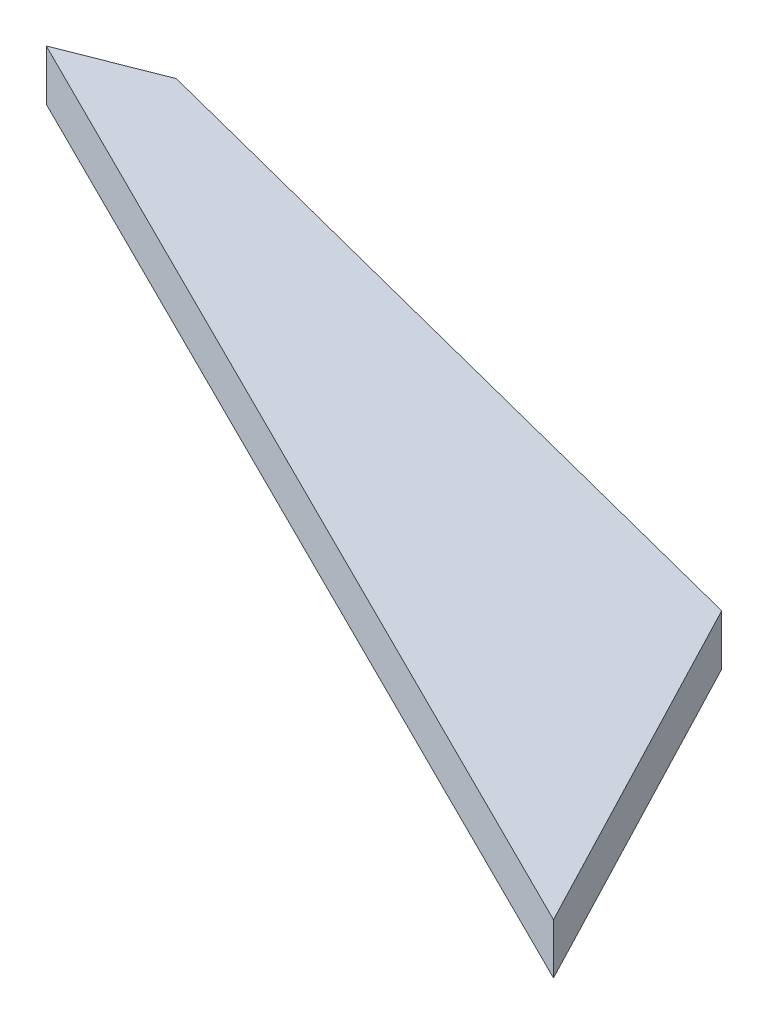
ISO-10303-21;
HEADER;
FILE_DESCRIPTION(('STEP AP214'),'2;1');
FILE_NAME('part.step','',(''),(''),'','','');
FILE_SCHEMA(('AUTOMOTIVE_DESIGN { 1 0 10303 214 1 1 1 1 }'));
ENDSEC;
DATA;
#1=APPLICATION_CONTEXT('core data for automotive mechanical design processes');
#2=APPLICATION_PROTOCOL_DEFINITION('international standard','automotive_design',2000,#1);
#3=PRODUCT_CONTEXT('',#1,'mechanical');
#4=PRODUCT('Part','Part','',(#3));
#5=PRODUCT_RELATED_PRODUCT_CATEGORY('part','',(#4));
#6=PRODUCT_DEFINITION_FORMATION('','',#4);
#7=PRODUCT_DEFINITION_CONTEXT('part definition',#1,'design');
#8=PRODUCT_DEFINITION('design','',#6,#7);
#9=PRODUCT_DEFINITION_SHAPE('','',#8);
#10=(LENGTH_UNIT() NAMED_UNIT(*) SI_UNIT(.MILLI.,.METRE.));
#11=(NAMED_UNIT(*) PLANE_ANGLE_UNIT() SI_UNIT($,.RADIAN.));
#12=(NAMED_UNIT(*) SI_UNIT($,.STERADIAN.) SOLID_ANGLE_UNIT());
#13=UNCERTAINTY_MEASURE_WITH_UNIT(LENGTH_MEASURE(1.E-05),#10,'distance_accuracy_value','');
#14=(GEOMETRIC_REPRESENTATION_CONTEXT(3) GLOBAL_UNCERTAINTY_ASSIGNED_CONTEXT((#13)) GLOBAL_UNIT_ASSIGNED_CONTEXT((#10,
#11,#12)) REPRESENTATION_CONTEXT('',''));
#15=CARTESIAN_POINT('',(0.,0.,0.));
#16=DIRECTION('',(0.,0.,1.));
#17=DIRECTION('',(1.,0.,0.));
#18=AXIS2_PLACEMENT_3D('',#15,#16,#17);
#19=CARTESIAN_POINT('',(40.0101560381609,2.,19.9234418220999));
#20=DIRECTION('',(-0.886646778343677,0.,0.462447283971674));
#21=DIRECTION('',(0.462447283971674,0.,0.886646778343677));
#22=AXIS2_PLACEMENT_3D('',#19,#20,#21);
#23=PLANE('',#22);
#24=DIRECTION('',(-0.462447283971674,0.,-0.886646778343677));
#25=VECTOR('',#24,1.);
#26=CARTESIAN_POINT('',(40.0101560381609,0.,19.9234418220999));
#27=LINE('',#26,#25);
#28=CARTESIAN_POINT('',(40.0101560381609,0.,19.9234418220999));
#29=VERTEX_POINT('',#28);
#30=CARTESIAN_POINT('',(32.7469868103492,0.,5.99782084948619));
#31=VERTEX_POINT('',#30);
#32=EDGE_CURVE('E107',#29,#31,#27,.T.);
#33=ORIENTED_EDGE('',*,*,#32,.T.);
#34=DIRECTION('',(0.,-1.,0.));
#35=VECTOR('',#34,1.);
#36=CARTESIAN_POINT('',(32.7469868103492,2.,5.99782084948619));
#37=LINE('',#36,#35);
#38=CARTESIAN_POINT('',(32.7469868103492,2.,5.99782084948619));
#39=VERTEX_POINT('',#38);
#40=EDGE_CURVE('E11',#39,#31,#37,.T.);
#41=ORIENTED_EDGE('',*,*,#40,.F.);
#42=DIRECTION('',(-0.462447283971674,0.,-0.886646778343677));
#43=VECTOR('',#42,1.);
#44=CARTESIAN_POINT('',(40.0101560381609,2.,19.9234418220999));
#45=LINE('',#44,#43);
#46=CARTESIAN_POINT('',(40.0101560381609,2.,19.9234418220999));
#47=VERTEX_POINT('',#46);
#48=EDGE_CURVE('E91',#47,#39,#45,.T.);
#49=ORIENTED_EDGE('',*,*,#48,.F.);
#50=DIRECTION('',(0.,-1.,0.));
#51=VECTOR('',#50,1.);
#52=CARTESIAN_POINT('',(40.0101560381609,2.,19.9234418220999));
#53=LINE('',#52,#51);
#54=EDGE_CURVE('E103',#47,#29,#53,.T.);
#55=ORIENTED_EDGE('',*,*,#54,.T.);
#56=EDGE_LOOP('',(#33,#41,#49,#55));
#57=FACE_BOUND('',#56,.T.);
#58=ADVANCED_FACE('F39',(#57),#23,.F.);
#59=CARTESIAN_POINT('',(32.7469868103492,2.,5.99782084948619));
#60=DIRECTION('',(-0.248511149778872,0.,0.968629035511316));
#61=DIRECTION('',(0.968629035511316,0.,0.248511149778872));
#62=AXIS2_PLACEMENT_3D('',#59,#60,#61);
#63=PLANE('',#62);
#64=DIRECTION('',(-0.968629035511316,0.,-0.248511149778872));
#65=VECTOR('',#64,1.);
#66=CARTESIAN_POINT('',(32.7469868103492,0.,5.99782084948619));
#67=LINE('',#66,#65);
#68=CARTESIAN_POINT('',(3.68748967169713,0.,-1.45767426904508));
#69=VERTEX_POINT('',#68);
#70=EDGE_CURVE('E96',#31,#69,#67,.T.);
#71=ORIENTED_EDGE('',*,*,#70,.T.);
#72=DIRECTION('',(0.,-1.,0.));
#73=VECTOR('',#72,1.);
#74=CARTESIAN_POINT('',(3.68748967169713,2.,-1.45767426904508));
#75=LINE('',#74,#73);
#76=CARTESIAN_POINT('',(3.68748967169713,2.,-1.45767426904508));
#77=VERTEX_POINT('',#76);
#78=EDGE_CURVE('E48',#77,#69,#75,.T.);
#79=ORIENTED_EDGE('',*,*,#78,.F.);
#80=DIRECTION('',(-0.968629035511316,0.,-0.248511149778872));
#81=VECTOR('',#80,1.);
#82=CARTESIAN_POINT('',(32.7469868103492,2.,5.99782084948619));
#83=LINE('',#82,#81);
#84=EDGE_CURVE('E86',#39,#77,#83,.T.);
#85=ORIENTED_EDGE('',*,*,#84,.F.);
#86=ORIENTED_EDGE('',*,*,#40,.T.);
#87=EDGE_LOOP('',(#71,#79,#85,#86));
#88=FACE_BOUND('',#87,.T.);
#89=ADVANCED_FACE('F95',(#88),#63,.F.);
#90=CARTESIAN_POINT('',(3.68748967169713,2.,-1.45767426904508));
#91=DIRECTION('',(0.367621705108539,0.,0.92997542006931));
#92=DIRECTION('',(0.92997542006931,0.,-0.367621705108539));
#93=AXIS2_PLACEMENT_3D('',#90,#91,#92);
#94=PLANE('',#93);
#95=DIRECTION('',(-0.92997542006931,0.,0.367621705108539));
#96=VECTOR('',#95,1.);
#97=CARTESIAN_POINT('',(3.68748967169713,0.,-1.45767426904508));
#98=LINE('',#97,#96);
#99=CARTESIAN_POINT('',(0.,0.,0.));
#100=VERTEX_POINT('',#99);
#101=EDGE_CURVE('E73',#69,#100,#98,.T.);
#102=ORIENTED_EDGE('',*,*,#101,.T.);
#103=DIRECTION('',(0.,-1.,0.));
#104=VECTOR('',#103,1.);
#105=CARTESIAN_POINT('',(0.,2.,0.));
#106=LINE('',#105,#104);
#107=CARTESIAN_POINT('',(0.,2.,0.));
#108=VERTEX_POINT('',#107);
#109=EDGE_CURVE('E98',#108,#100,#106,.T.);
#110=ORIENTED_EDGE('',*,*,#109,.F.);
#111=DIRECTION('',(-0.92997542006931,0.,0.367621705108539));
#112=VECTOR('',#111,1.);
#113=CARTESIAN_POINT('',(3.68748967169713,2.,-1.45767426904508));
#114=LINE('',#113,#112);
#115=EDGE_CURVE('E89',#77,#108,#114,.T.);
#116=ORIENTED_EDGE('',*,*,#115,.F.);
#117=ORIENTED_EDGE('',*,*,#78,.T.);
#118=EDGE_LOOP('',(#102,#110,#116,#117));
#119=FACE_BOUND('',#118,.T.);
#120=ADVANCED_FACE('F99',(#119),#94,.F.);
#121=CARTESIAN_POINT('',(0.,2.,0.));
#122=DIRECTION('',(0.445751826150914,0.,-0.895156583779132));
#123=DIRECTION('',(-0.895156583779132,0.,-0.445751826150914));
#124=AXIS2_PLACEMENT_3D('',#121,#122,#123);
#125=PLANE('',#124);
#126=DIRECTION('',(0.895156583779132,0.,0.445751826150914));
#127=VECTOR('',#126,1.);
#128=CARTESIAN_POINT('',(0.,0.,0.));
#129=LINE('',#128,#127);
#130=EDGE_CURVE('E79',#100,#29,#129,.T.);
#131=ORIENTED_EDGE('',*,*,#130,.T.);
#132=ORIENTED_EDGE('',*,*,#54,.F.);
#133=DIRECTION('',(0.895156583779132,0.,0.445751826150914));
#134=VECTOR('',#133,1.);
#135=CARTESIAN_POINT('',(0.,2.,0.));
#136=LINE('',#135,#134);
#137=EDGE_CURVE('E56',#108,#47,#136,.T.);
#138=ORIENTED_EDGE('',*,*,#137,.F.);
#139=ORIENTED_EDGE('',*,*,#109,.T.);
#140=EDGE_LOOP('',(#131,#132,#138,#139));
#141=FACE_BOUND('',#140,.T.);
#142=ADVANCED_FACE('F120',(#141),#125,.F.);
#143=CARTESIAN_POINT('',(0.,2.,0.));
#144=DIRECTION('',(0.,1.,0.));
#145=DIRECTION('',(0.,0.,1.));
#146=AXIS2_PLACEMENT_3D('',#143,#144,#145);
#147=PLANE('',#146);
#148=ORIENTED_EDGE('',*,*,#48,.T.);
#149=ORIENTED_EDGE('',*,*,#84,.T.);
#150=ORIENTED_EDGE('',*,*,#115,.T.);
#151=ORIENTED_EDGE('',*,*,#137,.T.);
#152=EDGE_LOOP('',(#148,#149,#150,#151));
#153=FACE_BOUND('',#152,.T.);
#154=ADVANCED_FACE('F87',(#153),#147,.T.);
#155=CARTESIAN_POINT('',(0.,0.,0.));
#156=DIRECTION('',(0.,1.,0.));
#157=DIRECTION('',(0.,0.,1.));
#158=AXIS2_PLACEMENT_3D('',#155,#156,#157);
#159=PLANE('',#158);
#160=ORIENTED_EDGE('',*,*,#32,.F.);
#161=ORIENTED_EDGE('',*,*,#130,.F.);
#162=ORIENTED_EDGE('',*,*,#101,.F.);
#163=ORIENTED_EDGE('',*,*,#70,.F.);
#164=EDGE_LOOP('',(#160,#161,#162,#163));
#165=FACE_BOUND('',#164,.T.);
#166=ADVANCED_FACE('F123',(#165),#159,.F.);
#167=CLOSED_SHELL('',(#58,#89,#120,#142,#154,#166));
#168=MANIFOLD_SOLID_BREP('B2',#167);
#169=ADVANCED_BREP_SHAPE_REPRESENTATION('',(#18,#168),#14);
#170=SHAPE_DEFINITION_REPRESENTATION(#9,#169);
ENDSEC;
END-ISO-10303-21;
